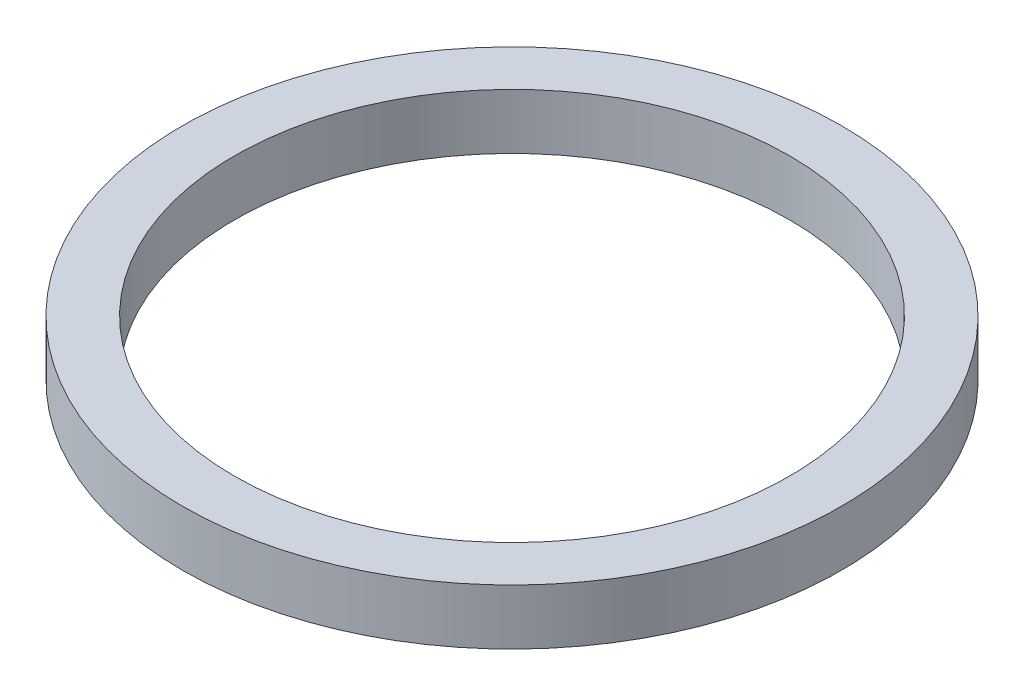
ISO-10303-21;
HEADER;
FILE_DESCRIPTION(('STEP AP214'),'2;1');
FILE_NAME('part.step','',(''),(''),'','','');
FILE_SCHEMA(('AUTOMOTIVE_DESIGN { 1 0 10303 214 1 1 1 1 }'));
ENDSEC;
DATA;
#1=APPLICATION_CONTEXT('core data for automotive mechanical design processes');
#2=APPLICATION_PROTOCOL_DEFINITION('international standard','automotive_design',2000,#1);
#3=PRODUCT_CONTEXT('',#1,'mechanical');
#4=PRODUCT('Part','Part','',(#3));
#5=PRODUCT_RELATED_PRODUCT_CATEGORY('part','',(#4));
#6=PRODUCT_DEFINITION_FORMATION('','',#4);
#7=PRODUCT_DEFINITION_CONTEXT('part definition',#1,'design');
#8=PRODUCT_DEFINITION('design','',#6,#7);
#9=PRODUCT_DEFINITION_SHAPE('','',#8);
#10=(LENGTH_UNIT() NAMED_UNIT(*) SI_UNIT(.MILLI.,.METRE.));
#11=(NAMED_UNIT(*) PLANE_ANGLE_UNIT() SI_UNIT($,.RADIAN.));
#12=(NAMED_UNIT(*) SI_UNIT($,.STERADIAN.) SOLID_ANGLE_UNIT());
#13=UNCERTAINTY_MEASURE_WITH_UNIT(LENGTH_MEASURE(1.E-05),#10,'distance_accuracy_value','');
#14=(GEOMETRIC_REPRESENTATION_CONTEXT(3) GLOBAL_UNCERTAINTY_ASSIGNED_CONTEXT((#13)) GLOBAL_UNIT_ASSIGNED_CONTEXT((#10,
#11,#12)) REPRESENTATION_CONTEXT('',''));
#15=CARTESIAN_POINT('',(0.,0.,0.));
#16=DIRECTION('',(0.,0.,1.));
#17=DIRECTION('',(1.,0.,0.));
#18=AXIS2_PLACEMENT_3D('',#15,#16,#17);
#19=CARTESIAN_POINT('',(0.,8.,0.));
#20=DIRECTION('',(0.,-1.,0.));
#21=DIRECTION('',(0.,0.,-1.));
#22=AXIS2_PLACEMENT_3D('',#19,#20,#21);
#23=CYLINDRICAL_SURFACE('',#22,47.5);
#24=CARTESIAN_POINT('',(0.,8.,0.));
#25=DIRECTION('',(0.,1.,0.));
#26=DIRECTION('',(0.,0.,1.));
#27=AXIS2_PLACEMENT_3D('',#24,#25,#26);
#28=CIRCLE('',#27,47.5);
#29=CARTESIAN_POINT('',(0.,8.,47.5));
#30=VERTEX_POINT('',#29);
#31=EDGE_CURVE('E10',#30,#30,#28,.T.);
#32=ORIENTED_EDGE('',*,*,#31,.F.);
#33=EDGE_LOOP('',(#32));
#34=FACE_BOUND('',#33,.T.);
#35=CARTESIAN_POINT('',(0.,0.,0.));
#36=DIRECTION('',(0.,1.,0.));
#37=DIRECTION('',(0.,0.,1.));
#38=AXIS2_PLACEMENT_3D('',#35,#36,#37);
#39=CIRCLE('',#38,47.5);
#40=CARTESIAN_POINT('',(0.,0.,47.5));
#41=VERTEX_POINT('',#40);
#42=EDGE_CURVE('E37',#41,#41,#39,.T.);
#43=ORIENTED_EDGE('',*,*,#42,.T.);
#44=EDGE_LOOP('',(#43));
#45=FACE_BOUND('',#44,.T.);
#46=ADVANCED_FACE('F40',(#34,#45),#23,.T.);
#47=CARTESIAN_POINT('',(0.,8.,0.));
#48=DIRECTION('',(0.,1.,0.));
#49=DIRECTION('',(0.,0.,1.));
#50=AXIS2_PLACEMENT_3D('',#47,#48,#49);
#51=PLANE('',#50);
#52=CARTESIAN_POINT('',(0.,8.,0.));
#53=DIRECTION('',(0.,1.,0.));
#54=DIRECTION('',(0.,0.,1.));
#55=AXIS2_PLACEMENT_3D('',#52,#53,#54);
#56=CIRCLE('',#55,40.);
#57=CARTESIAN_POINT('',(0.,8.,40.));
#58=VERTEX_POINT('',#57);
#59=EDGE_CURVE('E50',#58,#58,#56,.T.);
#60=ORIENTED_EDGE('',*,*,#59,.F.);
#61=EDGE_LOOP('',(#60));
#62=FACE_BOUND('',#61,.T.);
#63=ORIENTED_EDGE('',*,*,#31,.T.);
#64=EDGE_LOOP('',(#63));
#65=FACE_BOUND('',#64,.T.);
#66=ADVANCED_FACE('F59',(#62,#65),#51,.T.);
#67=CARTESIAN_POINT('',(0.,0.,0.));
#68=DIRECTION('',(0.,1.,0.));
#69=DIRECTION('',(0.,0.,1.));
#70=AXIS2_PLACEMENT_3D('',#67,#68,#69);
#71=PLANE('',#70);
#72=CARTESIAN_POINT('',(0.,0.,0.));
#73=DIRECTION('',(0.,1.,0.));
#74=DIRECTION('',(0.,0.,1.));
#75=AXIS2_PLACEMENT_3D('',#72,#73,#74);
#76=CIRCLE('',#75,40.);
#77=CARTESIAN_POINT('',(0.,0.,40.));
#78=VERTEX_POINT('',#77);
#79=EDGE_CURVE('E47',#78,#78,#76,.T.);
#80=ORIENTED_EDGE('',*,*,#79,.T.);
#81=EDGE_LOOP('',(#80));
#82=FACE_BOUND('',#81,.T.);
#83=ORIENTED_EDGE('',*,*,#42,.F.);
#84=EDGE_LOOP('',(#83));
#85=FACE_BOUND('',#84,.T.);
#86=ADVANCED_FACE('F58',(#82,#85),#71,.F.);
#87=CARTESIAN_POINT('',(0.,8.,0.));
#88=DIRECTION('',(0.,-1.,0.));
#89=DIRECTION('',(0.,0.,-1.));
#90=AXIS2_PLACEMENT_3D('',#87,#88,#89);
#91=CYLINDRICAL_SURFACE('',#90,40.);
#92=ORIENTED_EDGE('',*,*,#59,.T.);
#93=EDGE_LOOP('',(#92));
#94=FACE_BOUND('',#93,.T.);
#95=ORIENTED_EDGE('',*,*,#79,.F.);
#96=EDGE_LOOP('',(#95));
#97=FACE_BOUND('',#96,.T.);
#98=ADVANCED_FACE('F54',(#94,#97),#91,.F.);
#99=CLOSED_SHELL('',(#46,#66,#86,#98));
#100=MANIFOLD_SOLID_BREP('B2',#99);
#101=ADVANCED_BREP_SHAPE_REPRESENTATION('',(#18,#100),#14);
#102=SHAPE_DEFINITION_REPRESENTATION(#9,#101);
ENDSEC;
END-ISO-10303-21;
